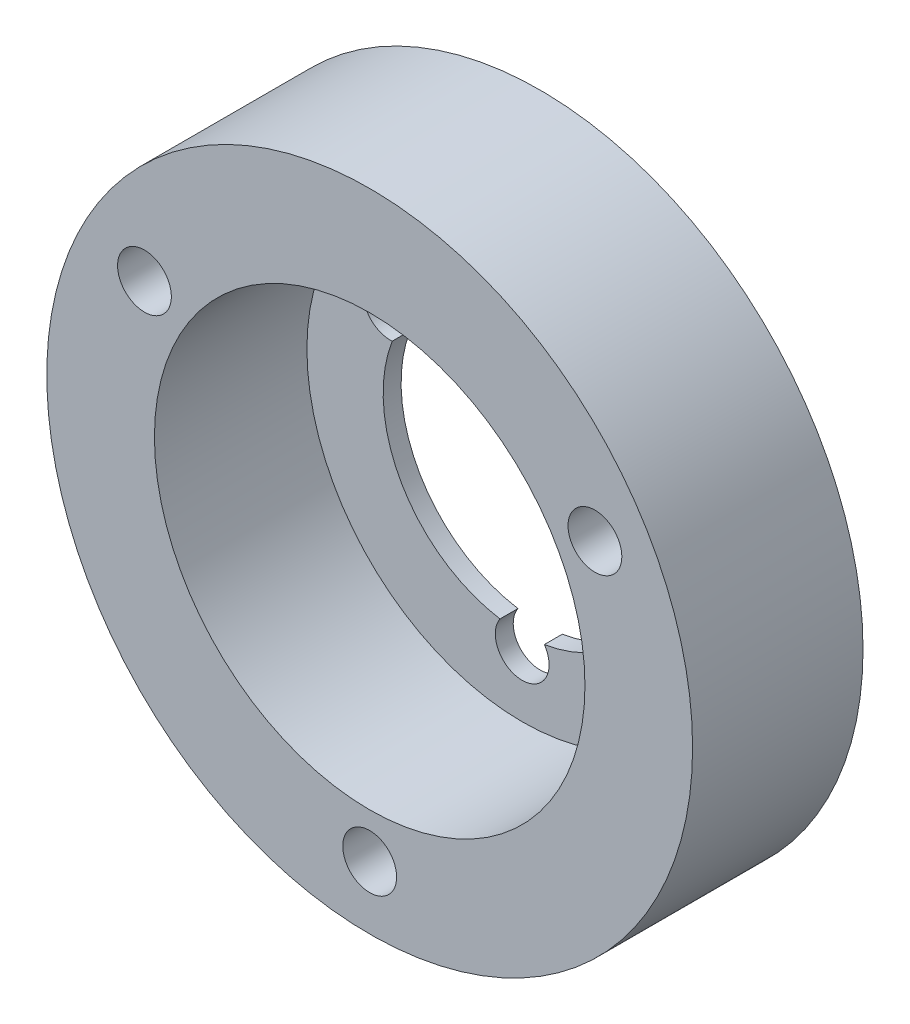
ISO-10303-21;
HEADER;
FILE_DESCRIPTION(('STEP AP214'),'2;1');
FILE_NAME('part.step','',(''),(''),'','','');
FILE_SCHEMA(('AUTOMOTIVE_DESIGN { 1 0 10303 214 1 1 1 1 }'));
ENDSEC;
DATA;
#1=APPLICATION_CONTEXT('core data for automotive mechanical design processes');
#2=APPLICATION_PROTOCOL_DEFINITION('international standard','automotive_design',2000,#1);
#3=PRODUCT_CONTEXT('',#1,'mechanical');
#4=PRODUCT('Part','Part','',(#3));
#5=PRODUCT_RELATED_PRODUCT_CATEGORY('part','',(#4));
#6=PRODUCT_DEFINITION_FORMATION('','',#4);
#7=PRODUCT_DEFINITION_CONTEXT('part definition',#1,'design');
#8=PRODUCT_DEFINITION('design','',#6,#7);
#9=PRODUCT_DEFINITION_SHAPE('','',#8);
#10=(LENGTH_UNIT() NAMED_UNIT(*) SI_UNIT(.MILLI.,.METRE.));
#11=(NAMED_UNIT(*) PLANE_ANGLE_UNIT() SI_UNIT($,.RADIAN.));
#12=(NAMED_UNIT(*) SI_UNIT($,.STERADIAN.) SOLID_ANGLE_UNIT());
#13=UNCERTAINTY_MEASURE_WITH_UNIT(LENGTH_MEASURE(1.E-05),#10,'distance_accuracy_value','');
#14=(GEOMETRIC_REPRESENTATION_CONTEXT(3) GLOBAL_UNCERTAINTY_ASSIGNED_CONTEXT((#13)) GLOBAL_UNIT_ASSIGNED_CONTEXT((#10,
#11,#12)) REPRESENTATION_CONTEXT('',''));
#15=CARTESIAN_POINT('',(0.,0.,0.));
#16=DIRECTION('',(0.,0.,1.));
#17=DIRECTION('',(1.,0.,0.));
#18=AXIS2_PLACEMENT_3D('',#15,#16,#17);
#19=CARTESIAN_POINT('',(50.,45.,9.49999999999999));
#20=DIRECTION('',(0.,0.,-1.));
#21=DIRECTION('',(-1.,0.,0.));
#22=AXIS2_PLACEMENT_3D('',#19,#20,#21);
#23=PLANE('',#22);
#24=CARTESIAN_POINT('',(12.445,29.7486326296758,9.5));
#25=DIRECTION('',(0.,0.,1.));
#26=DIRECTION('',(1.,0.,0.));
#27=AXIS2_PLACEMENT_3D('',#24,#25,#26);
#28=CIRCLE('',#27,1.5);
#29=CARTESIAN_POINT('',(13.945,29.7486326296758,9.5));
#30=VERTEX_POINT('',#29);
#31=EDGE_CURVE('E112',#30,#30,#28,.T.);
#32=ORIENTED_EDGE('',*,*,#31,.F.);
#33=EDGE_LOOP('',(#32));
#34=FACE_BOUND('',#33,.T.);
#35=CARTESIAN_POINT('',(37.555,29.7486326296758,9.5));
#36=DIRECTION('',(0.,0.,1.));
#37=DIRECTION('',(1.,0.,0.));
#38=AXIS2_PLACEMENT_3D('',#35,#36,#37);
#39=CIRCLE('',#38,1.5);
#40=CARTESIAN_POINT('',(39.055,29.7486326296758,9.5));
#41=VERTEX_POINT('',#40);
#42=EDGE_CURVE('E108',#41,#41,#39,.T.);
#43=ORIENTED_EDGE('',*,*,#42,.F.);
#44=EDGE_LOOP('',(#43));
#45=FACE_BOUND('',#44,.T.);
#46=CARTESIAN_POINT('',(25.,8.0027347406485,9.5));
#47=DIRECTION('',(0.,0.,1.));
#48=DIRECTION('',(1.,0.,0.));
#49=AXIS2_PLACEMENT_3D('',#46,#47,#48);
#50=CIRCLE('',#49,1.5);
#51=CARTESIAN_POINT('',(26.5,8.0027347406485,9.5));
#52=VERTEX_POINT('',#51);
#53=EDGE_CURVE('E104',#52,#52,#50,.T.);
#54=ORIENTED_EDGE('',*,*,#53,.F.);
#55=EDGE_LOOP('',(#54));
#56=FACE_BOUND('',#55,.T.);
#57=CARTESIAN_POINT('',(25.,22.5,9.5));
#58=DIRECTION('',(0.,0.,1.));
#59=DIRECTION('',(1.,0.,0.));
#60=AXIS2_PLACEMENT_3D('',#57,#58,#59);
#61=CIRCLE('',#60,12.);
#62=CARTESIAN_POINT('',(37.,22.5,9.5));
#63=VERTEX_POINT('',#62);
#64=EDGE_CURVE('E166',#63,#63,#61,.T.);
#65=ORIENTED_EDGE('',*,*,#64,.F.);
#66=EDGE_LOOP('',(#65));
#67=FACE_BOUND('',#66,.T.);
#68=CARTESIAN_POINT('',(25.,22.5,9.5));
#69=DIRECTION('',(0.,0.,1.));
#70=DIRECTION('',(1.,0.,0.));
#71=AXIS2_PLACEMENT_3D('',#68,#69,#70);
#72=CIRCLE('',#71,18.);
#73=CARTESIAN_POINT('',(43.,22.5,9.5));
#74=VERTEX_POINT('',#73);
#75=EDGE_CURVE('E172',#74,#74,#72,.T.);
#76=ORIENTED_EDGE('',*,*,#75,.T.);
#77=EDGE_LOOP('',(#76));
#78=FACE_BOUND('',#77,.T.);
#79=ADVANCED_FACE('F33',(#34,#45,#56,#67,#78),#23,.F.);
#80=CARTESIAN_POINT('',(0.,45.,0.));
#81=DIRECTION('',(0.,0.,1.));
#82=DIRECTION('',(1.,0.,0.));
#83=AXIS2_PLACEMENT_3D('',#80,#81,#82);
#84=PLANE('',#83);
#85=CARTESIAN_POINT('',(12.445,29.7486326296758,0.));
#86=DIRECTION('',(0.,0.,1.));
#87=DIRECTION('',(1.,0.,0.));
#88=AXIS2_PLACEMENT_3D('',#85,#86,#87);
#89=CIRCLE('',#88,1.5);
#90=CARTESIAN_POINT('',(13.945,29.7486326296758,0.));
#91=VERTEX_POINT('',#90);
#92=EDGE_CURVE('E115',#91,#91,#89,.T.);
#93=ORIENTED_EDGE('',*,*,#92,.T.);
#94=EDGE_LOOP('',(#93));
#95=FACE_BOUND('',#94,.T.);
#96=CARTESIAN_POINT('',(37.555,29.7486326296758,0.));
#97=DIRECTION('',(0.,0.,1.));
#98=DIRECTION('',(1.,0.,0.));
#99=AXIS2_PLACEMENT_3D('',#96,#97,#98);
#100=CIRCLE('',#99,1.5);
#101=CARTESIAN_POINT('',(39.055,29.7486326296758,0.));
#102=VERTEX_POINT('',#101);
#103=EDGE_CURVE('E111',#102,#102,#100,.T.);
#104=ORIENTED_EDGE('',*,*,#103,.T.);
#105=EDGE_LOOP('',(#104));
#106=FACE_BOUND('',#105,.T.);
#107=CARTESIAN_POINT('',(25.,8.0027347406485,0.));
#108=DIRECTION('',(0.,0.,1.));
#109=DIRECTION('',(1.,0.,0.));
#110=AXIS2_PLACEMENT_3D('',#107,#108,#109);
#111=CIRCLE('',#110,1.5);
#112=CARTESIAN_POINT('',(26.5,8.0027347406485,0.));
#113=VERTEX_POINT('',#112);
#114=EDGE_CURVE('E107',#113,#113,#111,.T.);
#115=ORIENTED_EDGE('',*,*,#114,.T.);
#116=EDGE_LOOP('',(#115));
#117=FACE_BOUND('',#116,.T.);
#118=CARTESIAN_POINT('',(32.3612159321678,26.7499999999999,0.));
#119=DIRECTION('',(0.,0.,1.));
#120=DIRECTION('',(1.,0.,0.));
#121=AXIS2_PLACEMENT_3D('',#118,#119,#120);
#122=CIRCLE('',#121,1.5);
#123=CARTESIAN_POINT('',(32.2439441639614,25.254591249062,0.));
#124=VERTEX_POINT('',#123);
#125=CARTESIAN_POINT('',(31.0075180807108,27.3961440450555,0.));
#126=VERTEX_POINT('',#125);
#127=EDGE_CURVE('E132',#124,#126,#122,.T.);
#128=ORIENTED_EDGE('',*,*,#127,.T.);
#129=CARTESIAN_POINT('',(25.,22.5,0.));
#130=DIRECTION('',(0.,0.,1.));
#131=DIRECTION('',(1.,0.,0.));
#132=AXIS2_PLACEMENT_3D('',#129,#130,#131);
#133=CIRCLE('',#132,7.75);
#134=CARTESIAN_POINT('',(18.9924819192892,27.3961440450555,0.));
#135=VERTEX_POINT('',#134);
#136=EDGE_CURVE('E40',#126,#135,#133,.T.);
#137=ORIENTED_EDGE('',*,*,#136,.T.);
#138=CARTESIAN_POINT('',(17.6387840678322,26.7499999999999,0.));
#139=DIRECTION('',(0.,0.,1.));
#140=DIRECTION('',(1.,0.,0.));
#141=AXIS2_PLACEMENT_3D('',#138,#139,#140);
#142=CIRCLE('',#141,1.5);
#143=CARTESIAN_POINT('',(17.7560558360386,25.254591249062,0.));
#144=VERTEX_POINT('',#143);
#145=EDGE_CURVE('E98',#135,#144,#142,.T.);
#146=ORIENTED_EDGE('',*,*,#145,.T.);
#147=CARTESIAN_POINT('',(25.,22.5,0.));
#148=DIRECTION('',(0.,0.,1.));
#149=DIRECTION('',(1.,0.,0.));
#150=AXIS2_PLACEMENT_3D('',#147,#148,#149);
#151=CIRCLE('',#150,7.75);
#152=CARTESIAN_POINT('',(23.7635739167493,14.8492647058824,0.));
#153=VERTEX_POINT('',#152);
#154=EDGE_CURVE('E123',#144,#153,#151,.T.);
#155=ORIENTED_EDGE('',*,*,#154,.T.);
#156=CARTESIAN_POINT('',(25.,14.,0.));
#157=DIRECTION('',(0.,0.,1.));
#158=DIRECTION('',(1.,0.,0.));
#159=AXIS2_PLACEMENT_3D('',#156,#157,#158);
#160=CIRCLE('',#159,1.5);
#161=CARTESIAN_POINT('',(26.2364260832507,14.8492647058824,0.));
#162=VERTEX_POINT('',#161);
#163=EDGE_CURVE('E126',#153,#162,#160,.T.);
#164=ORIENTED_EDGE('',*,*,#163,.T.);
#165=CARTESIAN_POINT('',(25.,22.5,0.));
#166=DIRECTION('',(0.,0.,1.));
#167=DIRECTION('',(1.,0.,0.));
#168=AXIS2_PLACEMENT_3D('',#165,#166,#167);
#169=CIRCLE('',#168,7.75);
#170=EDGE_CURVE('E129',#162,#124,#169,.T.);
#171=ORIENTED_EDGE('',*,*,#170,.T.);
#172=EDGE_LOOP('',(#128,#137,#146,#155,#164,#171));
#173=FACE_BOUND('',#172,.T.);
#174=CARTESIAN_POINT('',(25.,22.5,0.));
#175=DIRECTION('',(0.,0.,1.));
#176=DIRECTION('',(1.,0.,0.));
#177=AXIS2_PLACEMENT_3D('',#174,#175,#176);
#178=CIRCLE('',#177,18.);
#179=CARTESIAN_POINT('',(43.,22.5,0.));
#180=VERTEX_POINT('',#179);
#181=EDGE_CURVE('E169',#180,#180,#178,.T.);
#182=ORIENTED_EDGE('',*,*,#181,.F.);
#183=EDGE_LOOP('',(#182));
#184=FACE_BOUND('',#183,.T.);
#185=ADVANCED_FACE('F135',(#95,#106,#117,#173,#184),#84,.F.);
#186=CARTESIAN_POINT('',(25.,22.5,-35.5));
#187=DIRECTION('',(0.,0.,1.));
#188=DIRECTION('',(1.,0.,0.));
#189=AXIS2_PLACEMENT_3D('',#186,#187,#188);
#190=CYLINDRICAL_SURFACE('',#189,7.75);
#191=CARTESIAN_POINT('',(25.,22.5,1.));
#192=DIRECTION('',(0.,0.,1.));
#193=DIRECTION('',(1.,0.,0.));
#194=AXIS2_PLACEMENT_3D('',#191,#192,#193);
#195=CIRCLE('',#194,7.75);
#196=CARTESIAN_POINT('',(18.9924819192892,27.3961440450555,1.));
#197=VERTEX_POINT('',#196);
#198=CARTESIAN_POINT('',(31.0075180807108,27.3961440450555,1.));
#199=VERTEX_POINT('',#198);
#200=EDGE_CURVE('E83',#197,#199,#195,.F.);
#201=ORIENTED_EDGE('',*,*,#200,.F.);
#202=DIRECTION('',(0.,0.,1.));
#203=VECTOR('',#202,1.);
#204=CARTESIAN_POINT('',(18.9924819192892,27.3961440450555,-35.5));
#205=LINE('',#204,#203);
#206=EDGE_CURVE('E90',#135,#197,#205,.T.);
#207=ORIENTED_EDGE('',*,*,#206,.F.);
#208=ORIENTED_EDGE('',*,*,#136,.F.);
#209=DIRECTION('',(0.,0.,1.));
#210=VECTOR('',#209,1.);
#211=CARTESIAN_POINT('',(31.0075180807108,27.3961440450555,-35.5));
#212=LINE('',#211,#210);
#213=EDGE_CURVE('E93',#126,#199,#212,.T.);
#214=ORIENTED_EDGE('',*,*,#213,.T.);
#215=EDGE_LOOP('',(#201,#207,#208,#214));
#216=FACE_BOUND('',#215,.T.);
#217=ADVANCED_FACE('F89',(#216),#190,.F.);
#218=CARTESIAN_POINT('',(32.3612159321678,26.7499999999999,-35.5));
#219=DIRECTION('',(0.,0.,1.));
#220=DIRECTION('',(1.,0.,0.));
#221=AXIS2_PLACEMENT_3D('',#218,#219,#220);
#222=CYLINDRICAL_SURFACE('',#221,1.5);
#223=CARTESIAN_POINT('',(32.3612159321678,26.7499999999999,1.));
#224=DIRECTION('',(0.,0.,1.));
#225=DIRECTION('',(1.,0.,0.));
#226=AXIS2_PLACEMENT_3D('',#223,#224,#225);
#227=CIRCLE('',#226,1.5);
#228=CARTESIAN_POINT('',(32.2439441639614,25.254591249062,1.));
#229=VERTEX_POINT('',#228);
#230=EDGE_CURVE('E94',#199,#229,#227,.F.);
#231=ORIENTED_EDGE('',*,*,#230,.F.);
#232=ORIENTED_EDGE('',*,*,#213,.F.);
#233=ORIENTED_EDGE('',*,*,#127,.F.);
#234=DIRECTION('',(0.,0.,1.));
#235=VECTOR('',#234,1.);
#236=CARTESIAN_POINT('',(32.2439441639614,25.254591249062,-35.5));
#237=LINE('',#236,#235);
#238=EDGE_CURVE('E141',#124,#229,#237,.T.);
#239=ORIENTED_EDGE('',*,*,#238,.T.);
#240=EDGE_LOOP('',(#231,#232,#233,#239));
#241=FACE_BOUND('',#240,.T.);
#242=ADVANCED_FACE('F138',(#241),#222,.F.);
#243=CARTESIAN_POINT('',(25.,22.5,-35.5));
#244=DIRECTION('',(0.,0.,1.));
#245=DIRECTION('',(1.,0.,0.));
#246=AXIS2_PLACEMENT_3D('',#243,#244,#245);
#247=CYLINDRICAL_SURFACE('',#246,7.75);
#248=CARTESIAN_POINT('',(25.,22.5,1.));
#249=DIRECTION('',(0.,0.,1.));
#250=DIRECTION('',(1.,0.,0.));
#251=AXIS2_PLACEMENT_3D('',#248,#249,#250);
#252=CIRCLE('',#251,7.75);
#253=CARTESIAN_POINT('',(26.2364260832507,14.8492647058824,1.));
#254=VERTEX_POINT('',#253);
#255=EDGE_CURVE('E160',#229,#254,#252,.F.);
#256=ORIENTED_EDGE('',*,*,#255,.F.);
#257=ORIENTED_EDGE('',*,*,#238,.F.);
#258=ORIENTED_EDGE('',*,*,#170,.F.);
#259=DIRECTION('',(0.,0.,1.));
#260=VECTOR('',#259,1.);
#261=CARTESIAN_POINT('',(26.2364260832507,14.8492647058824,-35.5));
#262=LINE('',#261,#260);
#263=EDGE_CURVE('E143',#162,#254,#262,.T.);
#264=ORIENTED_EDGE('',*,*,#263,.T.);
#265=EDGE_LOOP('',(#256,#257,#258,#264));
#266=FACE_BOUND('',#265,.T.);
#267=ADVANCED_FACE('F159',(#266),#247,.F.);
#268=CARTESIAN_POINT('',(25.,14.,-35.5));
#269=DIRECTION('',(0.,0.,1.));
#270=DIRECTION('',(1.,0.,0.));
#271=AXIS2_PLACEMENT_3D('',#268,#269,#270);
#272=CYLINDRICAL_SURFACE('',#271,1.5);
#273=CARTESIAN_POINT('',(25.,14.,1.));
#274=DIRECTION('',(0.,0.,1.));
#275=DIRECTION('',(1.,0.,0.));
#276=AXIS2_PLACEMENT_3D('',#273,#274,#275);
#277=CIRCLE('',#276,1.5);
#278=CARTESIAN_POINT('',(23.7635739167493,14.8492647058824,1.));
#279=VERTEX_POINT('',#278);
#280=EDGE_CURVE('E154',#254,#279,#277,.F.);
#281=ORIENTED_EDGE('',*,*,#280,.F.);
#282=ORIENTED_EDGE('',*,*,#263,.F.);
#283=ORIENTED_EDGE('',*,*,#163,.F.);
#284=DIRECTION('',(0.,0.,1.));
#285=VECTOR('',#284,1.);
#286=CARTESIAN_POINT('',(23.7635739167493,14.8492647058824,-35.5));
#287=LINE('',#286,#285);
#288=EDGE_CURVE('E100',#153,#279,#287,.T.);
#289=ORIENTED_EDGE('',*,*,#288,.T.);
#290=EDGE_LOOP('',(#281,#282,#283,#289));
#291=FACE_BOUND('',#290,.T.);
#292=ADVANCED_FACE('F152',(#291),#272,.F.);
#293=CARTESIAN_POINT('',(25.,22.5,-35.5));
#294=DIRECTION('',(0.,0.,1.));
#295=DIRECTION('',(1.,0.,0.));
#296=AXIS2_PLACEMENT_3D('',#293,#294,#295);
#297=CYLINDRICAL_SURFACE('',#296,7.75);
#298=CARTESIAN_POINT('',(25.,22.5,1.));
#299=DIRECTION('',(0.,0.,1.));
#300=DIRECTION('',(1.,0.,0.));
#301=AXIS2_PLACEMENT_3D('',#298,#299,#300);
#302=CIRCLE('',#301,7.75);
#303=CARTESIAN_POINT('',(17.7560558360386,25.254591249062,0.999999999999987));
#304=VERTEX_POINT('',#303);
#305=EDGE_CURVE('E46',#279,#304,#302,.F.);
#306=ORIENTED_EDGE('',*,*,#305,.F.);
#307=ORIENTED_EDGE('',*,*,#288,.F.);
#308=ORIENTED_EDGE('',*,*,#154,.F.);
#309=DIRECTION('',(0.,0.,1.));
#310=VECTOR('',#309,1.);
#311=CARTESIAN_POINT('',(17.7560558360386,25.254591249062,-35.5));
#312=LINE('',#311,#310);
#313=EDGE_CURVE('E53',#144,#304,#312,.T.);
#314=ORIENTED_EDGE('',*,*,#313,.T.);
#315=EDGE_LOOP('',(#306,#307,#308,#314));
#316=FACE_BOUND('',#315,.T.);
#317=ADVANCED_FACE('F156',(#316),#297,.F.);
#318=CARTESIAN_POINT('',(17.6387840678322,26.7499999999999,-35.5));
#319=DIRECTION('',(0.,0.,1.));
#320=DIRECTION('',(1.,0.,0.));
#321=AXIS2_PLACEMENT_3D('',#318,#319,#320);
#322=CYLINDRICAL_SURFACE('',#321,1.5);
#323=CARTESIAN_POINT('',(17.6387840678322,26.7499999999999,1.));
#324=DIRECTION('',(0.,0.,1.));
#325=DIRECTION('',(1.,0.,0.));
#326=AXIS2_PLACEMENT_3D('',#323,#324,#325);
#327=CIRCLE('',#326,1.5);
#328=EDGE_CURVE('E11',#304,#197,#327,.F.);
#329=ORIENTED_EDGE('',*,*,#328,.F.);
#330=ORIENTED_EDGE('',*,*,#313,.F.);
#331=ORIENTED_EDGE('',*,*,#145,.F.);
#332=ORIENTED_EDGE('',*,*,#206,.T.);
#333=EDGE_LOOP('',(#329,#330,#331,#332));
#334=FACE_BOUND('',#333,.T.);
#335=ADVANCED_FACE('F96',(#334),#322,.F.);
#336=CARTESIAN_POINT('',(12.445,29.7486326296758,-35.5));
#337=DIRECTION('',(0.,0.,1.));
#338=DIRECTION('',(1.,0.,0.));
#339=AXIS2_PLACEMENT_3D('',#336,#337,#338);
#340=CYLINDRICAL_SURFACE('',#339,1.5);
#341=ORIENTED_EDGE('',*,*,#31,.T.);
#342=EDGE_LOOP('',(#341));
#343=FACE_BOUND('',#342,.T.);
#344=ORIENTED_EDGE('',*,*,#92,.F.);
#345=EDGE_LOOP('',(#344));
#346=FACE_BOUND('',#345,.T.);
#347=ADVANCED_FACE('F190',(#343,#346),#340,.F.);
#348=CARTESIAN_POINT('',(37.555,29.7486326296758,-35.5));
#349=DIRECTION('',(0.,0.,1.));
#350=DIRECTION('',(1.,0.,0.));
#351=AXIS2_PLACEMENT_3D('',#348,#349,#350);
#352=CYLINDRICAL_SURFACE('',#351,1.5);
#353=ORIENTED_EDGE('',*,*,#42,.T.);
#354=EDGE_LOOP('',(#353));
#355=FACE_BOUND('',#354,.T.);
#356=ORIENTED_EDGE('',*,*,#103,.F.);
#357=EDGE_LOOP('',(#356));
#358=FACE_BOUND('',#357,.T.);
#359=ADVANCED_FACE('F193',(#355,#358),#352,.F.);
#360=CARTESIAN_POINT('',(25.,8.0027347406485,-35.5));
#361=DIRECTION('',(0.,0.,1.));
#362=DIRECTION('',(1.,0.,0.));
#363=AXIS2_PLACEMENT_3D('',#360,#361,#362);
#364=CYLINDRICAL_SURFACE('',#363,1.5);
#365=ORIENTED_EDGE('',*,*,#53,.T.);
#366=EDGE_LOOP('',(#365));
#367=FACE_BOUND('',#366,.T.);
#368=ORIENTED_EDGE('',*,*,#114,.F.);
#369=EDGE_LOOP('',(#368));
#370=FACE_BOUND('',#369,.T.);
#371=ADVANCED_FACE('F197',(#367,#370),#364,.F.);
#372=CARTESIAN_POINT('',(25.,22.5,0.999999999999999));
#373=DIRECTION('',(0.,0.,1.));
#374=DIRECTION('',(1.,0.,0.));
#375=AXIS2_PLACEMENT_3D('',#372,#373,#374);
#376=PLANE('',#375);
#377=CARTESIAN_POINT('',(25.,22.5,0.999999999999999));
#378=DIRECTION('',(0.,0.,1.));
#379=DIRECTION('',(1.,0.,0.));
#380=AXIS2_PLACEMENT_3D('',#377,#378,#379);
#381=CIRCLE('',#380,12.);
#382=CARTESIAN_POINT('',(37.,22.5,0.999999999999999));
#383=VERTEX_POINT('',#382);
#384=EDGE_CURVE('E165',#383,#383,#381,.T.);
#385=ORIENTED_EDGE('',*,*,#384,.T.);
#386=EDGE_LOOP('',(#385));
#387=FACE_BOUND('',#386,.T.);
#388=ORIENTED_EDGE('',*,*,#200,.T.);
#389=ORIENTED_EDGE('',*,*,#230,.T.);
#390=ORIENTED_EDGE('',*,*,#255,.T.);
#391=ORIENTED_EDGE('',*,*,#280,.T.);
#392=ORIENTED_EDGE('',*,*,#305,.T.);
#393=ORIENTED_EDGE('',*,*,#328,.T.);
#394=EDGE_LOOP('',(#388,#389,#390,#391,#392,#393));
#395=FACE_BOUND('',#394,.T.);
#396=ADVANCED_FACE('F82',(#387,#395),#376,.T.);
#397=CARTESIAN_POINT('',(25.,22.5,0.999999999999999));
#398=DIRECTION('',(0.,0.,1.));
#399=DIRECTION('',(1.,0.,0.));
#400=AXIS2_PLACEMENT_3D('',#397,#398,#399);
#401=CYLINDRICAL_SURFACE('',#400,12.);
#402=ORIENTED_EDGE('',*,*,#384,.F.);
#403=EDGE_LOOP('',(#402));
#404=FACE_BOUND('',#403,.T.);
#405=ORIENTED_EDGE('',*,*,#64,.T.);
#406=EDGE_LOOP('',(#405));
#407=FACE_BOUND('',#406,.T.);
#408=ADVANCED_FACE('F212',(#404,#407),#401,.F.);
#409=CARTESIAN_POINT('',(25.,22.5,0.));
#410=DIRECTION('',(0.,0.,1.));
#411=DIRECTION('',(1.,0.,0.));
#412=AXIS2_PLACEMENT_3D('',#409,#410,#411);
#413=CYLINDRICAL_SURFACE('',#412,18.);
#414=ORIENTED_EDGE('',*,*,#181,.T.);
#415=EDGE_LOOP('',(#414));
#416=FACE_BOUND('',#415,.T.);
#417=ORIENTED_EDGE('',*,*,#75,.F.);
#418=EDGE_LOOP('',(#417));
#419=FACE_BOUND('',#418,.T.);
#420=ADVANCED_FACE('F178',(#416,#419),#413,.T.);
#421=CLOSED_SHELL('',(#79,#185,#217,#242,#267,#292,#317,#335,#347,#359,#371,#396,#408,#420));
#422=MANIFOLD_SOLID_BREP('B2',#421);
#423=ADVANCED_BREP_SHAPE_REPRESENTATION('',(#18,#422),#14);
#424=SHAPE_DEFINITION_REPRESENTATION(#9,#423);
ENDSEC;
END-ISO-10303-21;
